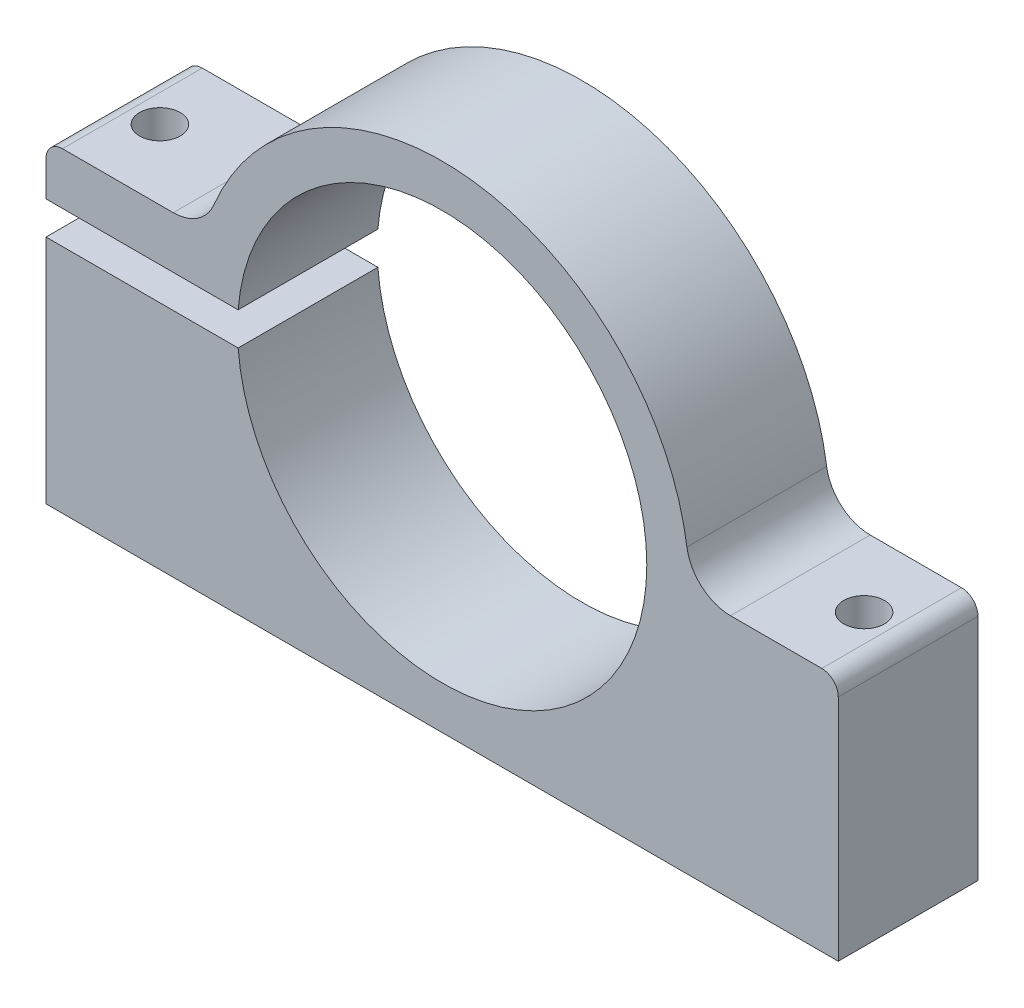
ISO-10303-21;
HEADER;
FILE_DESCRIPTION(('STEP AP214'),'2;1');
FILE_NAME('part.step','',(''),(''),'','','');
FILE_SCHEMA(('AUTOMOTIVE_DESIGN { 1 0 10303 214 1 1 1 1 }'));
ENDSEC;
DATA;
#1=APPLICATION_CONTEXT('core data for automotive mechanical design processes');
#2=APPLICATION_PROTOCOL_DEFINITION('international standard','automotive_design',2000,#1);
#3=PRODUCT_CONTEXT('',#1,'mechanical');
#4=PRODUCT('Part','Part','',(#3));
#5=PRODUCT_RELATED_PRODUCT_CATEGORY('part','',(#4));
#6=PRODUCT_DEFINITION_FORMATION('','',#4);
#7=PRODUCT_DEFINITION_CONTEXT('part definition',#1,'design');
#8=PRODUCT_DEFINITION('design','',#6,#7);
#9=PRODUCT_DEFINITION_SHAPE('','',#8);
#10=(LENGTH_UNIT() NAMED_UNIT(*) SI_UNIT(.MILLI.,.METRE.));
#11=(NAMED_UNIT(*) PLANE_ANGLE_UNIT() SI_UNIT($,.RADIAN.));
#12=(NAMED_UNIT(*) SI_UNIT($,.STERADIAN.) SOLID_ANGLE_UNIT());
#13=UNCERTAINTY_MEASURE_WITH_UNIT(LENGTH_MEASURE(1.E-05),#10,'distance_accuracy_value','');
#14=(GEOMETRIC_REPRESENTATION_CONTEXT(3) GLOBAL_UNCERTAINTY_ASSIGNED_CONTEXT((#13)) GLOBAL_UNIT_ASSIGNED_CONTEXT((#10,
#11,#12)) REPRESENTATION_CONTEXT('',''));
#15=CARTESIAN_POINT('',(0.,0.,0.));
#16=DIRECTION('',(0.,0.,1.));
#17=DIRECTION('',(1.,0.,0.));
#18=AXIS2_PLACEMENT_3D('',#15,#16,#17);
#19=CARTESIAN_POINT('',(0.,1.5,-6.35));
#20=DIRECTION('',(0.,1.,0.));
#21=DIRECTION('',(-1.,0.,0.));
#22=AXIS2_PLACEMENT_3D('',#19,#20,#21);
#23=PLANE('',#22);
#24=CARTESIAN_POINT('',(-32.,1.49999999999999,0.));
#25=DIRECTION('',(0.,1.,0.));
#26=DIRECTION('',(-1.,0.,0.));
#27=AXIS2_PLACEMENT_3D('',#24,#25,#26);
#28=CIRCLE('',#27,1.85);
#29=CARTESIAN_POINT('',(-33.85,1.49999999999999,0.));
#30=VERTEX_POINT('',#29);
#31=EDGE_CURVE('E470',#30,#30,#28,.T.);
#32=ORIENTED_EDGE('',*,*,#31,.T.);
#33=EDGE_LOOP('',(#32));
#34=FACE_BOUND('',#33,.T.);
#35=DIRECTION('',(-1.,0.,0.));
#36=VECTOR('',#35,1.);
#37=CARTESIAN_POINT('',(0.,1.5,-6.35));
#38=LINE('',#37,#36);
#39=CARTESIAN_POINT('',(-18.5394174665765,1.5,-6.35));
#40=VERTEX_POINT('',#39);
#41=CARTESIAN_POINT('',(-36.,1.5,-6.35));
#42=VERTEX_POINT('',#41);
#43=EDGE_CURVE('E168',#40,#42,#38,.T.);
#44=ORIENTED_EDGE('',*,*,#43,.F.);
#45=DIRECTION('',(0.,0.,1.));
#46=VECTOR('',#45,1.);
#47=CARTESIAN_POINT('',(-18.5394174665765,1.5,-6.35));
#48=LINE('',#47,#46);
#49=CARTESIAN_POINT('',(-18.5394174665765,1.5,6.35));
#50=VERTEX_POINT('',#49);
#51=EDGE_CURVE('E151',#40,#50,#48,.T.);
#52=ORIENTED_EDGE('',*,*,#51,.T.);
#53=DIRECTION('',(-1.,0.,0.));
#54=VECTOR('',#53,1.);
#55=CARTESIAN_POINT('',(0.,1.5,6.35));
#56=LINE('',#55,#54);
#57=CARTESIAN_POINT('',(-36.,1.5,6.35));
#58=VERTEX_POINT('',#57);
#59=EDGE_CURVE('E221',#50,#58,#56,.T.);
#60=ORIENTED_EDGE('',*,*,#59,.T.);
#61=DIRECTION('',(0.,0.,1.));
#62=VECTOR('',#61,1.);
#63=CARTESIAN_POINT('',(-36.,1.5,-6.35));
#64=LINE('',#63,#62);
#65=EDGE_CURVE('E176',#42,#58,#64,.T.);
#66=ORIENTED_EDGE('',*,*,#65,.F.);
#67=EDGE_LOOP('',(#44,#52,#60,#66));
#68=FACE_BOUND('',#67,.T.);
#69=ADVANCED_FACE('F16',(#34,#68),#23,.F.);
#70=CARTESIAN_POINT('',(-36.,1.5,-6.35));
#71=DIRECTION('',(1.,0.,0.));
#72=DIRECTION('',(0.,0.,-1.));
#73=AXIS2_PLACEMENT_3D('',#70,#71,#72);
#74=PLANE('',#73);
#75=DIRECTION('',(0.,1.,0.));
#76=VECTOR('',#75,1.);
#77=CARTESIAN_POINT('',(-36.,1.5,6.35));
#78=LINE('',#77,#76);
#79=CARTESIAN_POINT('',(-36.,4.69999999999999,6.35));
#80=VERTEX_POINT('',#79);
#81=EDGE_CURVE('E217',#58,#80,#78,.T.);
#82=ORIENTED_EDGE('',*,*,#81,.T.);
#83=DIRECTION('',(0.,0.,1.));
#84=VECTOR('',#83,1.);
#85=CARTESIAN_POINT('',(-36.,4.69999999999999,-6.35));
#86=LINE('',#85,#84);
#87=CARTESIAN_POINT('',(-36.,4.69999999999999,-6.35));
#88=VERTEX_POINT('',#87);
#89=EDGE_CURVE('E272',#80,#88,#86,.F.);
#90=ORIENTED_EDGE('',*,*,#89,.T.);
#91=DIRECTION('',(0.,1.,0.));
#92=VECTOR('',#91,1.);
#93=CARTESIAN_POINT('',(-36.,1.5,-6.35));
#94=LINE('',#93,#92);
#95=EDGE_CURVE('E180',#42,#88,#94,.T.);
#96=ORIENTED_EDGE('',*,*,#95,.F.);
#97=ORIENTED_EDGE('',*,*,#65,.T.);
#98=EDGE_LOOP('',(#82,#90,#96,#97));
#99=FACE_BOUND('',#98,.T.);
#100=ADVANCED_FACE('F349',(#99),#74,.F.);
#101=CARTESIAN_POINT('',(-36.,6.19999999999999,-6.35));
#102=DIRECTION('',(0.,-1.,0.));
#103=DIRECTION('',(0.,0.,-1.));
#104=AXIS2_PLACEMENT_3D('',#101,#102,#103);
#105=PLANE('',#104);
#106=CARTESIAN_POINT('',(-32.,6.2,0.));
#107=DIRECTION('',(0.,1.,0.));
#108=DIRECTION('',(-1.,0.,0.));
#109=AXIS2_PLACEMENT_3D('',#106,#107,#108);
#110=CIRCLE('',#109,1.85);
#111=CARTESIAN_POINT('',(-33.85,6.2,0.));
#112=VERTEX_POINT('',#111);
#113=EDGE_CURVE('E465',#112,#112,#110,.T.);
#114=ORIENTED_EDGE('',*,*,#113,.F.);
#115=EDGE_LOOP('',(#114));
#116=FACE_BOUND('',#115,.T.);
#117=DIRECTION('',(1.,0.,0.));
#118=VECTOR('',#117,1.);
#119=CARTESIAN_POINT('',(-36.,6.19999999999999,-6.35));
#120=LINE('',#119,#118);
#121=CARTESIAN_POINT('',(-34.5,6.19999999999999,-6.35));
#122=VERTEX_POINT('',#121);
#123=CARTESIAN_POINT('',(-24.4366609830394,6.19999999999999,-6.35));
#124=VERTEX_POINT('',#123);
#125=EDGE_CURVE('E189',#122,#124,#120,.T.);
#126=ORIENTED_EDGE('',*,*,#125,.F.);
#127=DIRECTION('',(0.,0.,1.));
#128=VECTOR('',#127,1.);
#129=CARTESIAN_POINT('',(-34.5,6.19999999999999,-6.35));
#130=LINE('',#129,#128);
#131=CARTESIAN_POINT('',(-34.5,6.19999999999999,6.35));
#132=VERTEX_POINT('',#131);
#133=EDGE_CURVE('E262',#122,#132,#130,.T.);
#134=ORIENTED_EDGE('',*,*,#133,.T.);
#135=DIRECTION('',(1.,0.,0.));
#136=VECTOR('',#135,1.);
#137=CARTESIAN_POINT('',(-36.,6.19999999999999,6.35));
#138=LINE('',#137,#136);
#139=CARTESIAN_POINT('',(-24.4366609830394,6.19999999999999,6.35));
#140=VERTEX_POINT('',#139);
#141=EDGE_CURVE('E214',#132,#140,#138,.T.);
#142=ORIENTED_EDGE('',*,*,#141,.T.);
#143=DIRECTION('',(0.,0.,1.));
#144=VECTOR('',#143,1.);
#145=CARTESIAN_POINT('',(-24.4366609830394,6.19999999999999,-6.35));
#146=LINE('',#145,#144);
#147=EDGE_CURVE('E240',#140,#124,#146,.F.);
#148=ORIENTED_EDGE('',*,*,#147,.T.);
#149=EDGE_LOOP('',(#126,#134,#142,#148));
#150=FACE_BOUND('',#149,.T.);
#151=ADVANCED_FACE('F322',(#116,#150),#105,.F.);
#152=CARTESIAN_POINT('',(0.,0.,-6.35));
#153=DIRECTION('',(0.,0.,1.));
#154=DIRECTION('',(1.,0.,0.));
#155=AXIS2_PLACEMENT_3D('',#152,#153,#154);
#156=CYLINDRICAL_SURFACE('',#155,22.48);
#157=CARTESIAN_POINT('',(0.,0.,-6.35));
#158=DIRECTION('',(0.,0.,1.));
#159=DIRECTION('',(1.,0.,0.));
#160=AXIS2_PLACEMENT_3D('',#157,#158,#159);
#161=CIRCLE('',#160,22.48);
#162=CARTESIAN_POINT('',(22.2473243549501,3.22598187311178,-6.35));
#163=VERTEX_POINT('',#162);
#164=CARTESIAN_POINT('',(-20.745322465964,8.65921450151057,-6.35));
#165=VERTEX_POINT('',#164);
#166=EDGE_CURVE('E305',#163,#165,#161,.T.);
#167=ORIENTED_EDGE('',*,*,#166,.T.);
#168=DIRECTION('',(0.,0.,1.));
#169=VECTOR('',#168,1.);
#170=CARTESIAN_POINT('',(-20.745322465964,8.65921450151057,-6.35));
#171=LINE('',#170,#169);
#172=CARTESIAN_POINT('',(-20.745322465964,8.65921450151057,6.35));
#173=VERTEX_POINT('',#172);
#174=EDGE_CURVE('E236',#165,#173,#171,.T.);
#175=ORIENTED_EDGE('',*,*,#174,.T.);
#176=CARTESIAN_POINT('',(0.,0.,6.35));
#177=DIRECTION('',(0.,0.,1.));
#178=DIRECTION('',(1.,0.,0.));
#179=AXIS2_PLACEMENT_3D('',#176,#177,#178);
#180=CIRCLE('',#179,22.48);
#181=CARTESIAN_POINT('',(22.2473243549501,3.22598187311178,6.35));
#182=VERTEX_POINT('',#181);
#183=EDGE_CURVE('E210',#182,#173,#180,.T.);
#184=ORIENTED_EDGE('',*,*,#183,.F.);
#185=DIRECTION('',(0.,0.,1.));
#186=VECTOR('',#185,1.);
#187=CARTESIAN_POINT('',(22.2473243549501,3.22598187311178,-6.35));
#188=LINE('',#187,#186);
#189=EDGE_CURVE('E233',#182,#163,#188,.F.);
#190=ORIENTED_EDGE('',*,*,#189,.T.);
#191=EDGE_LOOP('',(#167,#175,#184,#190));
#192=FACE_BOUND('',#191,.T.);
#193=ADVANCED_FACE('F328',(#192),#156,.T.);
#194=CARTESIAN_POINT('',(36.,-0.200000000000006,-6.35));
#195=DIRECTION('',(0.,1.,0.));
#196=DIRECTION('',(-1.,0.,0.));
#197=AXIS2_PLACEMENT_3D('',#194,#195,#196);
#198=PLANE('',#197);
#199=CARTESIAN_POINT('',(32.,-0.20000000000001,0.));
#200=DIRECTION('',(0.,1.,0.));
#201=DIRECTION('',(-1.,0.,0.));
#202=AXIS2_PLACEMENT_3D('',#199,#200,#201);
#203=CIRCLE('',#202,1.85);
#204=CARTESIAN_POINT('',(30.15,-0.20000000000001,0.));
#205=VERTEX_POINT('',#204);
#206=EDGE_CURVE('E460',#205,#205,#203,.T.);
#207=ORIENTED_EDGE('',*,*,#206,.F.);
#208=EDGE_LOOP('',(#207));
#209=FACE_BOUND('',#208,.T.);
#210=DIRECTION('',(-1.,0.,0.));
#211=VECTOR('',#210,1.);
#212=CARTESIAN_POINT('',(36.,-0.200000000000006,6.35));
#213=LINE('',#212,#211);
#214=CARTESIAN_POINT('',(34.5,-0.200000000000006,6.35));
#215=VERTEX_POINT('',#214);
#216=CARTESIAN_POINT('',(26.2059229946209,-0.200000000000007,6.35));
#217=VERTEX_POINT('',#216);
#218=EDGE_CURVE('E207',#215,#217,#213,.T.);
#219=ORIENTED_EDGE('',*,*,#218,.F.);
#220=DIRECTION('',(0.,0.,1.));
#221=VECTOR('',#220,1.);
#222=CARTESIAN_POINT('',(34.5,-0.200000000000006,-6.35));
#223=LINE('',#222,#221);
#224=CARTESIAN_POINT('',(34.5,-0.200000000000006,-6.35));
#225=VERTEX_POINT('',#224);
#226=EDGE_CURVE('E10',#215,#225,#223,.F.);
#227=ORIENTED_EDGE('',*,*,#226,.T.);
#228=DIRECTION('',(-1.,0.,0.));
#229=VECTOR('',#228,1.);
#230=CARTESIAN_POINT('',(36.,-0.200000000000006,-6.35));
#231=LINE('',#230,#229);
#232=CARTESIAN_POINT('',(26.2059229946209,-0.200000000000007,-6.35));
#233=VERTEX_POINT('',#232);
#234=EDGE_CURVE('E300',#225,#233,#231,.T.);
#235=ORIENTED_EDGE('',*,*,#234,.T.);
#236=DIRECTION('',(0.,0.,-1.));
#237=VECTOR('',#236,1.);
#238=CARTESIAN_POINT('',(26.2059229946209,-0.200000000000007,6.35));
#239=LINE('',#238,#237);
#240=EDGE_CURVE('E244',#233,#217,#239,.F.);
#241=ORIENTED_EDGE('',*,*,#240,.T.);
#242=EDGE_LOOP('',(#219,#227,#235,#241));
#243=FACE_BOUND('',#242,.T.);
#244=ADVANCED_FACE('F335',(#209,#243),#198,.T.);
#245=CARTESIAN_POINT('',(36.,-22.5,-6.35));
#246=DIRECTION('',(1.,0.,0.));
#247=DIRECTION('',(0.,1.,0.));
#248=AXIS2_PLACEMENT_3D('',#245,#246,#247);
#249=PLANE('',#248);
#250=DIRECTION('',(0.,1.,0.));
#251=VECTOR('',#250,1.);
#252=CARTESIAN_POINT('',(36.,-22.5,-6.35));
#253=LINE('',#252,#251);
#254=CARTESIAN_POINT('',(36.,-22.5,-6.35));
#255=VERTEX_POINT('',#254);
#256=CARTESIAN_POINT('',(36.,-1.70000000000001,-6.35));
#257=VERTEX_POINT('',#256);
#258=EDGE_CURVE('E286',#255,#257,#253,.T.);
#259=ORIENTED_EDGE('',*,*,#258,.T.);
#260=DIRECTION('',(0.,0.,1.));
#261=VECTOR('',#260,1.);
#262=CARTESIAN_POINT('',(36.,-1.70000000000001,-6.35));
#263=LINE('',#262,#261);
#264=CARTESIAN_POINT('',(36.,-1.70000000000001,6.35));
#265=VERTEX_POINT('',#264);
#266=EDGE_CURVE('E25',#257,#265,#263,.T.);
#267=ORIENTED_EDGE('',*,*,#266,.T.);
#268=DIRECTION('',(0.,1.,0.));
#269=VECTOR('',#268,1.);
#270=CARTESIAN_POINT('',(36.,-22.5,6.35));
#271=LINE('',#270,#269);
#272=CARTESIAN_POINT('',(36.,-22.5,6.35));
#273=VERTEX_POINT('',#272);
#274=EDGE_CURVE('E203',#273,#265,#271,.T.);
#275=ORIENTED_EDGE('',*,*,#274,.F.);
#276=DIRECTION('',(0.,0.,1.));
#277=VECTOR('',#276,1.);
#278=CARTESIAN_POINT('',(36.,-22.5,-6.35));
#279=LINE('',#278,#277);
#280=EDGE_CURVE('E226',#255,#273,#279,.T.);
#281=ORIENTED_EDGE('',*,*,#280,.F.);
#282=EDGE_LOOP('',(#259,#267,#275,#281));
#283=FACE_BOUND('',#282,.T.);
#284=ADVANCED_FACE('F285',(#283),#249,.T.);
#285=CARTESIAN_POINT('',(-36.,-22.5,-6.35));
#286=DIRECTION('',(0.,-1.,0.));
#287=DIRECTION('',(0.,0.,-1.));
#288=AXIS2_PLACEMENT_3D('',#285,#286,#287);
#289=PLANE('',#288);
#290=CARTESIAN_POINT('',(32.,-22.5,0.));
#291=DIRECTION('',(0.,1.,0.));
#292=DIRECTION('',(-1.,0.,0.));
#293=AXIS2_PLACEMENT_3D('',#290,#291,#292);
#294=CIRCLE('',#293,1.85);
#295=CARTESIAN_POINT('',(30.15,-22.5,0.));
#296=VERTEX_POINT('',#295);
#297=EDGE_CURVE('E456',#296,#296,#294,.T.);
#298=ORIENTED_EDGE('',*,*,#297,.T.);
#299=EDGE_LOOP('',(#298));
#300=FACE_BOUND('',#299,.T.);
#301=CARTESIAN_POINT('',(-32.,-22.5,0.));
#302=DIRECTION('',(0.,1.,0.));
#303=DIRECTION('',(-1.,0.,0.));
#304=AXIS2_PLACEMENT_3D('',#301,#302,#303);
#305=CIRCLE('',#304,1.85);
#306=CARTESIAN_POINT('',(-33.85,-22.5,0.));
#307=VERTEX_POINT('',#306);
#308=EDGE_CURVE('E173',#307,#307,#305,.T.);
#309=ORIENTED_EDGE('',*,*,#308,.T.);
#310=EDGE_LOOP('',(#309));
#311=FACE_BOUND('',#310,.T.);
#312=DIRECTION('',(1.,0.,0.));
#313=VECTOR('',#312,1.);
#314=CARTESIAN_POINT('',(-36.,-22.5,6.35));
#315=LINE('',#314,#313);
#316=CARTESIAN_POINT('',(-36.,-22.5,6.35));
#317=VERTEX_POINT('',#316);
#318=EDGE_CURVE('E199',#317,#273,#315,.T.);
#319=ORIENTED_EDGE('',*,*,#318,.F.);
#320=DIRECTION('',(0.,0.,1.));
#321=VECTOR('',#320,1.);
#322=CARTESIAN_POINT('',(-36.,-22.5,-6.35));
#323=LINE('',#322,#321);
#324=CARTESIAN_POINT('',(-36.,-22.5,-6.35));
#325=VERTEX_POINT('',#324);
#326=EDGE_CURVE('E187',#325,#317,#323,.T.);
#327=ORIENTED_EDGE('',*,*,#326,.F.);
#328=DIRECTION('',(1.,0.,0.));
#329=VECTOR('',#328,1.);
#330=CARTESIAN_POINT('',(-36.,-22.5,-6.35));
#331=LINE('',#330,#329);
#332=EDGE_CURVE('E297',#325,#255,#331,.T.);
#333=ORIENTED_EDGE('',*,*,#332,.T.);
#334=ORIENTED_EDGE('',*,*,#280,.T.);
#335=EDGE_LOOP('',(#319,#327,#333,#334));
#336=FACE_BOUND('',#335,.T.);
#337=ADVANCED_FACE('F294',(#300,#311,#336),#289,.T.);
#338=CARTESIAN_POINT('',(-36.,-1.5,-6.35));
#339=DIRECTION('',(-1.,0.,0.));
#340=DIRECTION('',(0.,-1.,0.));
#341=AXIS2_PLACEMENT_3D('',#338,#339,#340);
#342=PLANE('',#341);
#343=DIRECTION('',(0.,-1.,0.));
#344=VECTOR('',#343,1.);
#345=CARTESIAN_POINT('',(-36.,-1.5,6.35));
#346=LINE('',#345,#344);
#347=CARTESIAN_POINT('',(-36.,-1.5,6.35));
#348=VERTEX_POINT('',#347);
#349=EDGE_CURVE('E195',#348,#317,#346,.T.);
#350=ORIENTED_EDGE('',*,*,#349,.F.);
#351=DIRECTION('',(0.,0.,1.));
#352=VECTOR('',#351,1.);
#353=CARTESIAN_POINT('',(-36.,-1.5,-6.35));
#354=LINE('',#353,#352);
#355=CARTESIAN_POINT('',(-36.,-1.5,-6.35));
#356=VERTEX_POINT('',#355);
#357=EDGE_CURVE('E179',#356,#348,#354,.T.);
#358=ORIENTED_EDGE('',*,*,#357,.F.);
#359=DIRECTION('',(0.,-1.,0.));
#360=VECTOR('',#359,1.);
#361=CARTESIAN_POINT('',(-36.,-1.5,-6.35));
#362=LINE('',#361,#360);
#363=EDGE_CURVE('E307',#356,#325,#362,.T.);
#364=ORIENTED_EDGE('',*,*,#363,.T.);
#365=ORIENTED_EDGE('',*,*,#326,.T.);
#366=EDGE_LOOP('',(#350,#358,#364,#365));
#367=FACE_BOUND('',#366,.T.);
#368=ADVANCED_FACE('F373',(#367),#342,.T.);
#369=CARTESIAN_POINT('',(0.,-1.5,-6.35));
#370=DIRECTION('',(0.,1.,0.));
#371=DIRECTION('',(-1.,0.,0.));
#372=AXIS2_PLACEMENT_3D('',#369,#370,#371);
#373=PLANE('',#372);
#374=CARTESIAN_POINT('',(-32.,-1.5,0.));
#375=DIRECTION('',(0.,1.,0.));
#376=DIRECTION('',(-1.,0.,0.));
#377=AXIS2_PLACEMENT_3D('',#374,#375,#376);
#378=CIRCLE('',#377,1.85);
#379=CARTESIAN_POINT('',(-33.85,-1.5,0.));
#380=VERTEX_POINT('',#379);
#381=EDGE_CURVE('E472',#380,#380,#378,.T.);
#382=ORIENTED_EDGE('',*,*,#381,.F.);
#383=EDGE_LOOP('',(#382));
#384=FACE_BOUND('',#383,.T.);
#385=DIRECTION('',(0.,0.,1.));
#386=VECTOR('',#385,1.);
#387=CARTESIAN_POINT('',(-18.5394174665765,-1.5,-6.35));
#388=LINE('',#387,#386);
#389=CARTESIAN_POINT('',(-18.5394174665765,-1.5,-6.35));
#390=VERTEX_POINT('',#389);
#391=CARTESIAN_POINT('',(-18.5394174665765,-1.5,6.35));
#392=VERTEX_POINT('',#391);
#393=EDGE_CURVE('E163',#390,#392,#388,.T.);
#394=ORIENTED_EDGE('',*,*,#393,.F.);
#395=DIRECTION('',(-1.,0.,0.));
#396=VECTOR('',#395,1.);
#397=CARTESIAN_POINT('',(0.,-1.5,-6.35));
#398=LINE('',#397,#396);
#399=EDGE_CURVE('E171',#390,#356,#398,.T.);
#400=ORIENTED_EDGE('',*,*,#399,.T.);
#401=ORIENTED_EDGE('',*,*,#357,.T.);
#402=DIRECTION('',(-1.,0.,0.));
#403=VECTOR('',#402,1.);
#404=CARTESIAN_POINT('',(0.,-1.5,6.35));
#405=LINE('',#404,#403);
#406=EDGE_CURVE('E162',#392,#348,#405,.T.);
#407=ORIENTED_EDGE('',*,*,#406,.F.);
#408=EDGE_LOOP('',(#394,#400,#401,#407));
#409=FACE_BOUND('',#408,.T.);
#410=ADVANCED_FACE('F377',(#384,#409),#373,.T.);
#411=CARTESIAN_POINT('',(0.,0.,-6.35));
#412=DIRECTION('',(0.,0.,1.));
#413=DIRECTION('',(1.,0.,0.));
#414=AXIS2_PLACEMENT_3D('',#411,#412,#413);
#415=PLANE('',#414);
#416=ORIENTED_EDGE('',*,*,#95,.T.);
#417=CARTESIAN_POINT('',(-34.5,4.69999999999999,-6.35));
#418=DIRECTION('',(0.,0.,1.));
#419=DIRECTION('',(1.,0.,0.));
#420=AXIS2_PLACEMENT_3D('',#417,#418,#419);
#421=CIRCLE('',#420,1.5);
#422=EDGE_CURVE('E277',#88,#122,#421,.F.);
#423=ORIENTED_EDGE('',*,*,#422,.T.);
#424=ORIENTED_EDGE('',*,*,#125,.T.);
#425=CARTESIAN_POINT('',(-24.4366609830394,10.2,-6.35));
#426=DIRECTION('',(0.,0.,1.));
#427=DIRECTION('',(1.,0.,0.));
#428=AXIS2_PLACEMENT_3D('',#425,#426,#427);
#429=CIRCLE('',#428,4.);
#430=EDGE_CURVE('E252',#124,#165,#429,.T.);
#431=ORIENTED_EDGE('',*,*,#430,.T.);
#432=ORIENTED_EDGE('',*,*,#166,.F.);
#433=CARTESIAN_POINT('',(26.2059229946209,3.79999999999999,-6.35));
#434=DIRECTION('',(0.,0.,1.));
#435=DIRECTION('',(1.,0.,0.));
#436=AXIS2_PLACEMENT_3D('',#433,#434,#435);
#437=CIRCLE('',#436,4.);
#438=EDGE_CURVE('E258',#163,#233,#437,.T.);
#439=ORIENTED_EDGE('',*,*,#438,.T.);
#440=ORIENTED_EDGE('',*,*,#234,.F.);
#441=CARTESIAN_POINT('',(34.5,-1.70000000000001,-6.35));
#442=DIRECTION('',(0.,0.,1.));
#443=DIRECTION('',(1.,0.,0.));
#444=AXIS2_PLACEMENT_3D('',#441,#442,#443);
#445=CIRCLE('',#444,1.5);
#446=EDGE_CURVE('E37',#225,#257,#445,.F.);
#447=ORIENTED_EDGE('',*,*,#446,.T.);
#448=ORIENTED_EDGE('',*,*,#258,.F.);
#449=ORIENTED_EDGE('',*,*,#332,.F.);
#450=ORIENTED_EDGE('',*,*,#363,.F.);
#451=ORIENTED_EDGE('',*,*,#399,.F.);
#452=CARTESIAN_POINT('',(0.,0.,-6.35));
#453=DIRECTION('',(0.,0.,1.));
#454=DIRECTION('',(1.,0.,0.));
#455=AXIS2_PLACEMENT_3D('',#452,#453,#454);
#456=CIRCLE('',#455,18.6);
#457=EDGE_CURVE('E154',#390,#40,#456,.T.);
#458=ORIENTED_EDGE('',*,*,#457,.T.);
#459=ORIENTED_EDGE('',*,*,#43,.T.);
#460=EDGE_LOOP('',(#416,#423,#424,#431,#432,#439,#440,#447,#448,#449,#450,#451,#458,#459));
#461=FACE_BOUND('',#460,.T.);
#462=ADVANCED_FACE('F167',(#461),#415,.F.);
#463=CARTESIAN_POINT('',(0.,0.,6.35));
#464=DIRECTION('',(0.,0.,1.));
#465=DIRECTION('',(1.,0.,0.));
#466=AXIS2_PLACEMENT_3D('',#463,#464,#465);
#467=PLANE('',#466);
#468=ORIENTED_EDGE('',*,*,#141,.F.);
#469=CARTESIAN_POINT('',(-34.5,4.69999999999999,6.35));
#470=DIRECTION('',(0.,0.,1.));
#471=DIRECTION('',(1.,0.,0.));
#472=AXIS2_PLACEMENT_3D('',#469,#470,#471);
#473=CIRCLE('',#472,1.5);
#474=EDGE_CURVE('E269',#132,#80,#473,.T.);
#475=ORIENTED_EDGE('',*,*,#474,.T.);
#476=ORIENTED_EDGE('',*,*,#81,.F.);
#477=ORIENTED_EDGE('',*,*,#59,.F.);
#478=CARTESIAN_POINT('',(0.,0.,6.35));
#479=DIRECTION('',(0.,0.,1.));
#480=DIRECTION('',(1.,0.,0.));
#481=AXIS2_PLACEMENT_3D('',#478,#479,#480);
#482=CIRCLE('',#481,18.6);
#483=EDGE_CURVE('E157',#392,#50,#482,.T.);
#484=ORIENTED_EDGE('',*,*,#483,.F.);
#485=ORIENTED_EDGE('',*,*,#406,.T.);
#486=ORIENTED_EDGE('',*,*,#349,.T.);
#487=ORIENTED_EDGE('',*,*,#318,.T.);
#488=ORIENTED_EDGE('',*,*,#274,.T.);
#489=CARTESIAN_POINT('',(34.5,-1.70000000000001,6.35));
#490=DIRECTION('',(0.,0.,1.));
#491=DIRECTION('',(1.,0.,0.));
#492=AXIS2_PLACEMENT_3D('',#489,#490,#491);
#493=CIRCLE('',#492,1.5);
#494=EDGE_CURVE('E266',#265,#215,#493,.T.);
#495=ORIENTED_EDGE('',*,*,#494,.T.);
#496=ORIENTED_EDGE('',*,*,#218,.T.);
#497=CARTESIAN_POINT('',(26.2059229946209,3.79999999999999,6.35));
#498=DIRECTION('',(0.,0.,1.));
#499=DIRECTION('',(1.,0.,0.));
#500=AXIS2_PLACEMENT_3D('',#497,#498,#499);
#501=CIRCLE('',#500,4.);
#502=EDGE_CURVE('E255',#217,#182,#501,.F.);
#503=ORIENTED_EDGE('',*,*,#502,.T.);
#504=ORIENTED_EDGE('',*,*,#183,.T.);
#505=CARTESIAN_POINT('',(-24.4366609830394,10.2,6.35));
#506=DIRECTION('',(0.,0.,1.));
#507=DIRECTION('',(1.,0.,0.));
#508=AXIS2_PLACEMENT_3D('',#505,#506,#507);
#509=CIRCLE('',#508,4.);
#510=EDGE_CURVE('E248',#173,#140,#509,.F.);
#511=ORIENTED_EDGE('',*,*,#510,.T.);
#512=EDGE_LOOP('',(#468,#475,#476,#477,#484,#485,#486,#487,#488,#495,#496,#503,#504,#511));
#513=FACE_BOUND('',#512,.T.);
#514=ADVANCED_FACE('F290',(#513),#467,.T.);
#515=CARTESIAN_POINT('',(0.,0.,-6.35));
#516=DIRECTION('',(0.,0.,1.));
#517=DIRECTION('',(1.,0.,0.));
#518=AXIS2_PLACEMENT_3D('',#515,#516,#517);
#519=CYLINDRICAL_SURFACE('',#518,18.6);
#520=ORIENTED_EDGE('',*,*,#457,.F.);
#521=ORIENTED_EDGE('',*,*,#393,.T.);
#522=ORIENTED_EDGE('',*,*,#483,.T.);
#523=ORIENTED_EDGE('',*,*,#51,.F.);
#524=EDGE_LOOP('',(#520,#521,#522,#523));
#525=FACE_BOUND('',#524,.T.);
#526=ADVANCED_FACE('F153',(#525),#519,.F.);
#527=CARTESIAN_POINT('',(-24.4366609830394,10.2,-6.35));
#528=DIRECTION('',(0.,0.,1.));
#529=DIRECTION('',(1.,0.,0.));
#530=AXIS2_PLACEMENT_3D('',#527,#528,#529);
#531=CYLINDRICAL_SURFACE('',#530,4.);
#532=ORIENTED_EDGE('',*,*,#430,.F.);
#533=ORIENTED_EDGE('',*,*,#147,.F.);
#534=ORIENTED_EDGE('',*,*,#510,.F.);
#535=ORIENTED_EDGE('',*,*,#174,.F.);
#536=EDGE_LOOP('',(#532,#533,#534,#535));
#537=FACE_BOUND('',#536,.T.);
#538=ADVANCED_FACE('F325',(#537),#531,.F.);
#539=CARTESIAN_POINT('',(26.2059229946209,3.79999999999999,-6.35));
#540=DIRECTION('',(0.,0.,1.));
#541=DIRECTION('',(1.,0.,0.));
#542=AXIS2_PLACEMENT_3D('',#539,#540,#541);
#543=CYLINDRICAL_SURFACE('',#542,4.);
#544=ORIENTED_EDGE('',*,*,#438,.F.);
#545=ORIENTED_EDGE('',*,*,#189,.F.);
#546=ORIENTED_EDGE('',*,*,#502,.F.);
#547=ORIENTED_EDGE('',*,*,#240,.F.);
#548=EDGE_LOOP('',(#544,#545,#546,#547));
#549=FACE_BOUND('',#548,.T.);
#550=ADVANCED_FACE('F334',(#549),#543,.F.);
#551=CARTESIAN_POINT('',(-34.5,4.69999999999999,-6.35));
#552=DIRECTION('',(0.,0.,1.));
#553=DIRECTION('',(1.,0.,0.));
#554=AXIS2_PLACEMENT_3D('',#551,#552,#553);
#555=CYLINDRICAL_SURFACE('',#554,1.5);
#556=ORIENTED_EDGE('',*,*,#422,.F.);
#557=ORIENTED_EDGE('',*,*,#89,.F.);
#558=ORIENTED_EDGE('',*,*,#474,.F.);
#559=ORIENTED_EDGE('',*,*,#133,.F.);
#560=EDGE_LOOP('',(#556,#557,#558,#559));
#561=FACE_BOUND('',#560,.T.);
#562=ADVANCED_FACE('F338',(#561),#555,.T.);
#563=CARTESIAN_POINT('',(34.5,-1.70000000000001,-6.35));
#564=DIRECTION('',(0.,0.,1.));
#565=DIRECTION('',(1.,0.,0.));
#566=AXIS2_PLACEMENT_3D('',#563,#564,#565);
#567=CYLINDRICAL_SURFACE('',#566,1.5);
#568=ORIENTED_EDGE('',*,*,#446,.F.);
#569=ORIENTED_EDGE('',*,*,#226,.F.);
#570=ORIENTED_EDGE('',*,*,#494,.F.);
#571=ORIENTED_EDGE('',*,*,#266,.F.);
#572=EDGE_LOOP('',(#568,#569,#570,#571));
#573=FACE_BOUND('',#572,.T.);
#574=ADVANCED_FACE('F18',(#573),#567,.T.);
#575=CARTESIAN_POINT('',(-32.,-22.5,0.));
#576=DIRECTION('',(0.,1.,0.));
#577=DIRECTION('',(-1.,0.,0.));
#578=AXIS2_PLACEMENT_3D('',#575,#576,#577);
#579=CYLINDRICAL_SURFACE('',#578,1.85);
#580=ORIENTED_EDGE('',*,*,#381,.T.);
#581=EDGE_LOOP('',(#580));
#582=FACE_BOUND('',#581,.T.);
#583=ORIENTED_EDGE('',*,*,#308,.F.);
#584=EDGE_LOOP('',(#583));
#585=FACE_BOUND('',#584,.T.);
#586=ADVANCED_FACE('F337',(#582,#585),#579,.F.);
#587=CARTESIAN_POINT('',(-32.,-22.5,0.));
#588=DIRECTION('',(0.,1.,0.));
#589=DIRECTION('',(-1.,0.,0.));
#590=AXIS2_PLACEMENT_3D('',#587,#588,#589);
#591=CYLINDRICAL_SURFACE('',#590,1.85);
#592=ORIENTED_EDGE('',*,*,#113,.T.);
#593=EDGE_LOOP('',(#592));
#594=FACE_BOUND('',#593,.T.);
#595=ORIENTED_EDGE('',*,*,#31,.F.);
#596=EDGE_LOOP('',(#595));
#597=FACE_BOUND('',#596,.T.);
#598=ADVANCED_FACE('F344',(#594,#597),#591,.F.);
#599=CARTESIAN_POINT('',(32.,-22.5,0.));
#600=DIRECTION('',(0.,1.,0.));
#601=DIRECTION('',(-1.,0.,0.));
#602=AXIS2_PLACEMENT_3D('',#599,#600,#601);
#603=CYLINDRICAL_SURFACE('',#602,1.85);
#604=ORIENTED_EDGE('',*,*,#297,.F.);
#605=EDGE_LOOP('',(#604));
#606=FACE_BOUND('',#605,.T.);
#607=ORIENTED_EDGE('',*,*,#206,.T.);
#608=EDGE_LOOP('',(#607));
#609=FACE_BOUND('',#608,.T.);
#610=ADVANCED_FACE('F429',(#606,#609),#603,.F.);
#611=CLOSED_SHELL('',(#69,#100,#151,#193,#244,#284,#337,#368,#410,#462,#514,#526,#538,#550,#562,
#574,#586,#598,#610));
#612=MANIFOLD_SOLID_BREP('B1',#611);
#613=ADVANCED_BREP_SHAPE_REPRESENTATION('',(#18,#612),#14);
#614=SHAPE_DEFINITION_REPRESENTATION(#9,#613);
ENDSEC;
END-ISO-10303-21;
